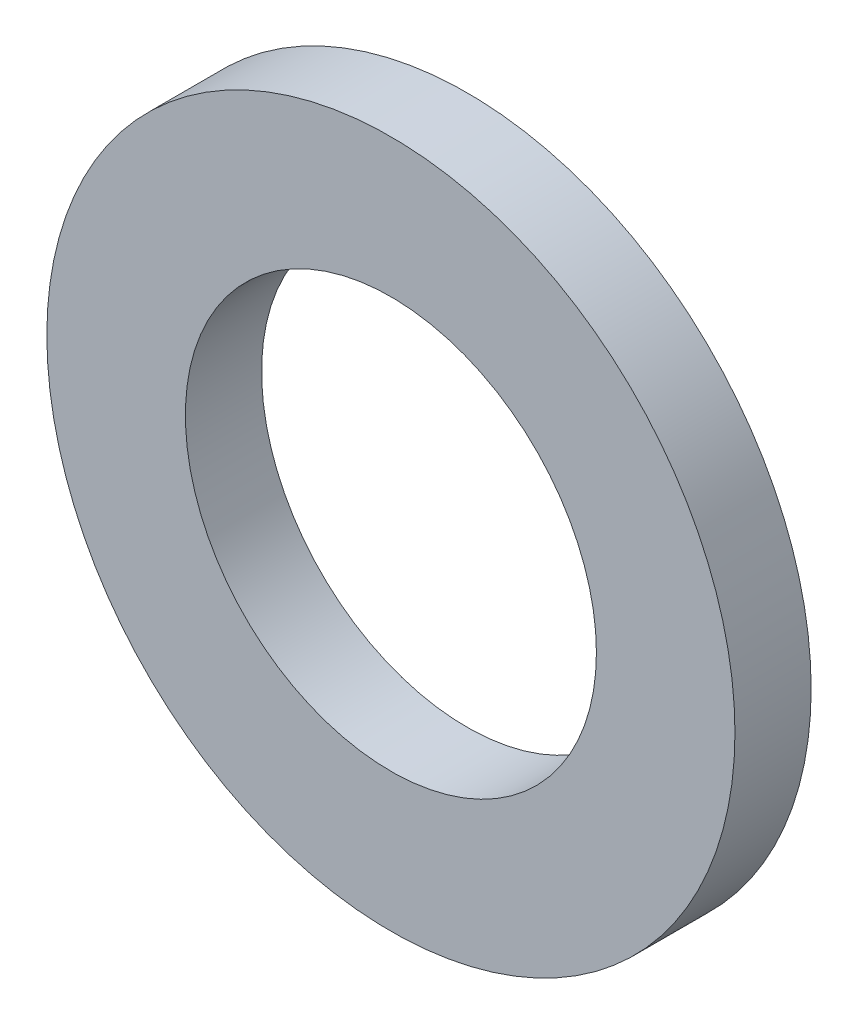
ISO-10303-21;
HEADER;
FILE_DESCRIPTION(('STEP AP214'),'2;1');
FILE_NAME('part.step','',(''),(''),'','','');
FILE_SCHEMA(('AUTOMOTIVE_DESIGN { 1 0 10303 214 1 1 1 1 }'));
ENDSEC;
DATA;
#1=APPLICATION_CONTEXT('core data for automotive mechanical design processes');
#2=APPLICATION_PROTOCOL_DEFINITION('international standard','automotive_design',2000,#1);
#3=PRODUCT_CONTEXT('',#1,'mechanical');
#4=PRODUCT('Part','Part','',(#3));
#5=PRODUCT_RELATED_PRODUCT_CATEGORY('part','',(#4));
#6=PRODUCT_DEFINITION_FORMATION('','',#4);
#7=PRODUCT_DEFINITION_CONTEXT('part definition',#1,'design');
#8=PRODUCT_DEFINITION('design','',#6,#7);
#9=PRODUCT_DEFINITION_SHAPE('','',#8);
#10=(LENGTH_UNIT() NAMED_UNIT(*) SI_UNIT(.MILLI.,.METRE.));
#11=(NAMED_UNIT(*) PLANE_ANGLE_UNIT() SI_UNIT($,.RADIAN.));
#12=(NAMED_UNIT(*) SI_UNIT($,.STERADIAN.) SOLID_ANGLE_UNIT());
#13=UNCERTAINTY_MEASURE_WITH_UNIT(LENGTH_MEASURE(1.E-05),#10,'distance_accuracy_value','');
#14=(GEOMETRIC_REPRESENTATION_CONTEXT(3) GLOBAL_UNCERTAINTY_ASSIGNED_CONTEXT((#13)) GLOBAL_UNIT_ASSIGNED_CONTEXT((#10,
#11,#12)) REPRESENTATION_CONTEXT('',''));
#15=CARTESIAN_POINT('',(0.,0.,0.));
#16=DIRECTION('',(0.,0.,1.));
#17=DIRECTION('',(1.,0.,0.));
#18=AXIS2_PLACEMENT_3D('',#15,#16,#17);
#19=CARTESIAN_POINT('',(0.,0.,0.20955));
#20=DIRECTION('',(0.,0.,1.));
#21=DIRECTION('',(1.,0.,0.));
#22=AXIS2_PLACEMENT_3D('',#19,#20,#21);
#23=PLANE('',#22);
#24=CARTESIAN_POINT('',(0.,0.,0.20955));
#25=DIRECTION('',(0.,0.,1.));
#26=DIRECTION('',(1.,0.,0.));
#27=AXIS2_PLACEMENT_3D('',#24,#25,#26);
#28=CIRCLE('',#27,1.8923);
#29=CARTESIAN_POINT('',(1.8923,0.,0.20955));
#30=VERTEX_POINT('',#29);
#31=EDGE_CURVE('E10',#30,#30,#28,.T.);
#32=ORIENTED_EDGE('',*,*,#31,.T.);
#33=EDGE_LOOP('',(#32));
#34=FACE_BOUND('',#33,.T.);
#35=CARTESIAN_POINT('',(0.,0.,0.20955));
#36=DIRECTION('',(0.,0.,1.));
#37=DIRECTION('',(1.,0.,0.));
#38=AXIS2_PLACEMENT_3D('',#35,#36,#37);
#39=CIRCLE('',#38,1.1303);
#40=CARTESIAN_POINT('',(1.1303,0.,0.20955));
#41=VERTEX_POINT('',#40);
#42=EDGE_CURVE('E43',#41,#41,#39,.T.);
#43=ORIENTED_EDGE('',*,*,#42,.F.);
#44=EDGE_LOOP('',(#43));
#45=FACE_BOUND('',#44,.T.);
#46=ADVANCED_FACE('F32',(#34,#45),#23,.T.);
#47=CARTESIAN_POINT('',(0.,0.,-0.20955));
#48=DIRECTION('',(0.,0.,1.));
#49=DIRECTION('',(1.,0.,0.));
#50=AXIS2_PLACEMENT_3D('',#47,#48,#49);
#51=PLANE('',#50);
#52=CARTESIAN_POINT('',(0.,0.,-0.20955));
#53=DIRECTION('',(0.,0.,1.));
#54=DIRECTION('',(1.,0.,0.));
#55=AXIS2_PLACEMENT_3D('',#52,#53,#54);
#56=CIRCLE('',#55,1.8923);
#57=CARTESIAN_POINT('',(1.8923,0.,-0.20955));
#58=VERTEX_POINT('',#57);
#59=EDGE_CURVE('E36',#58,#58,#56,.T.);
#60=ORIENTED_EDGE('',*,*,#59,.F.);
#61=EDGE_LOOP('',(#60));
#62=FACE_BOUND('',#61,.T.);
#63=CARTESIAN_POINT('',(0.,0.,-0.20955));
#64=DIRECTION('',(0.,0.,1.));
#65=DIRECTION('',(1.,0.,0.));
#66=AXIS2_PLACEMENT_3D('',#63,#64,#65);
#67=CIRCLE('',#66,1.1303);
#68=CARTESIAN_POINT('',(1.1303,0.,-0.20955));
#69=VERTEX_POINT('',#68);
#70=EDGE_CURVE('E45',#69,#69,#67,.T.);
#71=ORIENTED_EDGE('',*,*,#70,.T.);
#72=EDGE_LOOP('',(#71));
#73=FACE_BOUND('',#72,.T.);
#74=ADVANCED_FACE('F55',(#62,#73),#51,.F.);
#75=CARTESIAN_POINT('',(0.,0.,0.20955));
#76=DIRECTION('',(0.,0.,-1.));
#77=DIRECTION('',(-1.,0.,0.));
#78=AXIS2_PLACEMENT_3D('',#75,#76,#77);
#79=CYLINDRICAL_SURFACE('',#78,1.8923);
#80=ORIENTED_EDGE('',*,*,#31,.F.);
#81=EDGE_LOOP('',(#80));
#82=FACE_BOUND('',#81,.T.);
#83=ORIENTED_EDGE('',*,*,#59,.T.);
#84=EDGE_LOOP('',(#83));
#85=FACE_BOUND('',#84,.T.);
#86=ADVANCED_FACE('F34',(#82,#85),#79,.T.);
#87=CARTESIAN_POINT('',(0.,0.,0.20955));
#88=DIRECTION('',(0.,0.,-1.));
#89=DIRECTION('',(-1.,0.,0.));
#90=AXIS2_PLACEMENT_3D('',#87,#88,#89);
#91=CYLINDRICAL_SURFACE('',#90,1.1303);
#92=ORIENTED_EDGE('',*,*,#42,.T.);
#93=EDGE_LOOP('',(#92));
#94=FACE_BOUND('',#93,.T.);
#95=ORIENTED_EDGE('',*,*,#70,.F.);
#96=EDGE_LOOP('',(#95));
#97=FACE_BOUND('',#96,.T.);
#98=ADVANCED_FACE('F51',(#94,#97),#91,.F.);
#99=CLOSED_SHELL('',(#46,#74,#86,#98));
#100=MANIFOLD_SOLID_BREP('B2',#99);
#101=ADVANCED_BREP_SHAPE_REPRESENTATION('',(#18,#100),#14);
#102=SHAPE_DEFINITION_REPRESENTATION(#9,#101);
ENDSEC;
END-ISO-10303-21;
